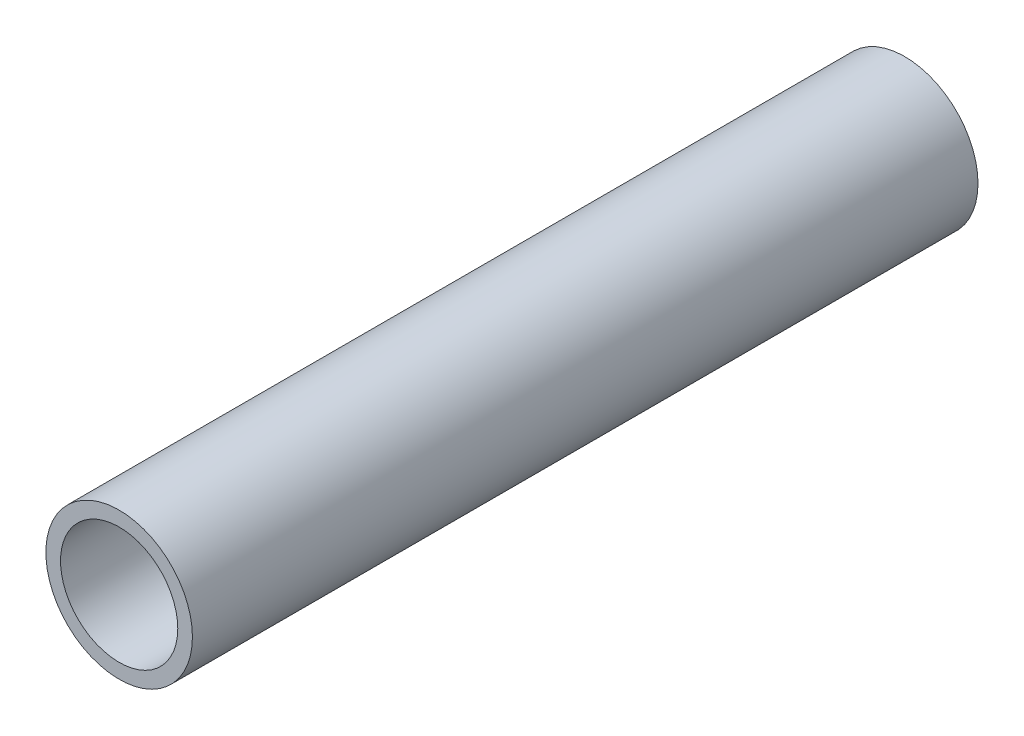
ISO-10303-21;
HEADER;
FILE_DESCRIPTION(('STEP AP214'),'2;1');
FILE_NAME('part.step','',(''),(''),'','','');
FILE_SCHEMA(('AUTOMOTIVE_DESIGN { 1 0 10303 214 1 1 1 1 }'));
ENDSEC;
DATA;
#1=APPLICATION_CONTEXT('core data for automotive mechanical design processes');
#2=APPLICATION_PROTOCOL_DEFINITION('international standard','automotive_design',2000,#1);
#3=PRODUCT_CONTEXT('',#1,'mechanical');
#4=PRODUCT('Part','Part','',(#3));
#5=PRODUCT_RELATED_PRODUCT_CATEGORY('part','',(#4));
#6=PRODUCT_DEFINITION_FORMATION('','',#4);
#7=PRODUCT_DEFINITION_CONTEXT('part definition',#1,'design');
#8=PRODUCT_DEFINITION('design','',#6,#7);
#9=PRODUCT_DEFINITION_SHAPE('','',#8);
#10=(LENGTH_UNIT() NAMED_UNIT(*) SI_UNIT(.MILLI.,.METRE.));
#11=(NAMED_UNIT(*) PLANE_ANGLE_UNIT() SI_UNIT($,.RADIAN.));
#12=(NAMED_UNIT(*) SI_UNIT($,.STERADIAN.) SOLID_ANGLE_UNIT());
#13=UNCERTAINTY_MEASURE_WITH_UNIT(LENGTH_MEASURE(1.E-05),#10,'distance_accuracy_value','');
#14=(GEOMETRIC_REPRESENTATION_CONTEXT(3) GLOBAL_UNCERTAINTY_ASSIGNED_CONTEXT((#13)) GLOBAL_UNIT_ASSIGNED_CONTEXT((#10,
#11,#12)) REPRESENTATION_CONTEXT('',''));
#15=CARTESIAN_POINT('',(0.,0.,0.));
#16=DIRECTION('',(0.,0.,1.));
#17=DIRECTION('',(1.,0.,0.));
#18=AXIS2_PLACEMENT_3D('',#15,#16,#17);
#19=CARTESIAN_POINT('',(0.,0.,469.));
#20=DIRECTION('',(0.,0.,-1.));
#21=DIRECTION('',(-1.,0.,0.));
#22=AXIS2_PLACEMENT_3D('',#19,#20,#21);
#23=CYLINDRICAL_SURFACE('',#22,43.75);
#24=CARTESIAN_POINT('',(0.,0.,469.));
#25=DIRECTION('',(0.,0.,1.));
#26=DIRECTION('',(1.,0.,0.));
#27=AXIS2_PLACEMENT_3D('',#24,#25,#26);
#28=CIRCLE('',#27,43.75);
#29=CARTESIAN_POINT('',(43.75,0.,469.));
#30=VERTEX_POINT('',#29);
#31=EDGE_CURVE('E10',#30,#30,#28,.T.);
#32=ORIENTED_EDGE('',*,*,#31,.F.);
#33=EDGE_LOOP('',(#32));
#34=FACE_BOUND('',#33,.T.);
#35=CARTESIAN_POINT('',(0.,0.,0.));
#36=DIRECTION('',(0.,0.,1.));
#37=DIRECTION('',(1.,0.,0.));
#38=AXIS2_PLACEMENT_3D('',#35,#36,#37);
#39=CIRCLE('',#38,43.75);
#40=CARTESIAN_POINT('',(43.75,0.,0.));
#41=VERTEX_POINT('',#40);
#42=EDGE_CURVE('E37',#41,#41,#39,.T.);
#43=ORIENTED_EDGE('',*,*,#42,.T.);
#44=EDGE_LOOP('',(#43));
#45=FACE_BOUND('',#44,.T.);
#46=ADVANCED_FACE('F34',(#34,#45),#23,.T.);
#47=CARTESIAN_POINT('',(0.,0.,469.));
#48=DIRECTION('',(0.,0.,1.));
#49=DIRECTION('',(1.,0.,0.));
#50=AXIS2_PLACEMENT_3D('',#47,#48,#49);
#51=PLANE('',#50);
#52=CARTESIAN_POINT('',(0.,0.,469.));
#53=DIRECTION('',(0.,0.,1.));
#54=DIRECTION('',(1.,0.,0.));
#55=AXIS2_PLACEMENT_3D('',#52,#53,#54);
#56=CIRCLE('',#55,35.);
#57=CARTESIAN_POINT('',(35.,0.,469.));
#58=VERTEX_POINT('',#57);
#59=EDGE_CURVE('E46',#58,#58,#56,.T.);
#60=ORIENTED_EDGE('',*,*,#59,.F.);
#61=EDGE_LOOP('',(#60));
#62=FACE_BOUND('',#61,.T.);
#63=ORIENTED_EDGE('',*,*,#31,.T.);
#64=EDGE_LOOP('',(#63));
#65=FACE_BOUND('',#64,.T.);
#66=ADVANCED_FACE('F61',(#62,#65),#51,.T.);
#67=CARTESIAN_POINT('',(0.,0.,0.));
#68=DIRECTION('',(0.,0.,1.));
#69=DIRECTION('',(1.,0.,0.));
#70=AXIS2_PLACEMENT_3D('',#67,#68,#69);
#71=PLANE('',#70);
#72=ORIENTED_EDGE('',*,*,#42,.F.);
#73=EDGE_LOOP('',(#72));
#74=FACE_BOUND('',#73,.T.);
#75=ADVANCED_FACE('F57',(#74),#71,.F.);
#76=CARTESIAN_POINT('',(0.,0.,6.99999999999995));
#77=DIRECTION('',(0.,0.,1.));
#78=DIRECTION('',(1.,0.,0.));
#79=AXIS2_PLACEMENT_3D('',#76,#77,#78);
#80=CYLINDRICAL_SURFACE('',#79,35.);
#81=CARTESIAN_POINT('',(0.,0.,6.99999999999995));
#82=DIRECTION('',(0.,0.,1.));
#83=DIRECTION('',(1.,0.,0.));
#84=AXIS2_PLACEMENT_3D('',#81,#82,#83);
#85=CIRCLE('',#84,35.);
#86=CARTESIAN_POINT('',(35.,0.,6.99999999999995));
#87=VERTEX_POINT('',#86);
#88=EDGE_CURVE('E44',#87,#87,#85,.T.);
#89=ORIENTED_EDGE('',*,*,#88,.F.);
#90=EDGE_LOOP('',(#89));
#91=FACE_BOUND('',#90,.T.);
#92=ORIENTED_EDGE('',*,*,#59,.T.);
#93=EDGE_LOOP('',(#92));
#94=FACE_BOUND('',#93,.T.);
#95=ADVANCED_FACE('F54',(#91,#94),#80,.F.);
#96=CARTESIAN_POINT('',(0.,0.,6.99999999999995));
#97=DIRECTION('',(0.,0.,1.));
#98=DIRECTION('',(1.,0.,0.));
#99=AXIS2_PLACEMENT_3D('',#96,#97,#98);
#100=PLANE('',#99);
#101=ORIENTED_EDGE('',*,*,#88,.T.);
#102=EDGE_LOOP('',(#101));
#103=FACE_BOUND('',#102,.T.);
#104=ADVANCED_FACE('F52',(#103),#100,.T.);
#105=CLOSED_SHELL('',(#46,#66,#75,#95,#104));
#106=MANIFOLD_SOLID_BREP('B2',#105);
#107=ADVANCED_BREP_SHAPE_REPRESENTATION('',(#18,#106),#14);
#108=SHAPE_DEFINITION_REPRESENTATION(#9,#107);
ENDSEC;
END-ISO-10303-21;
